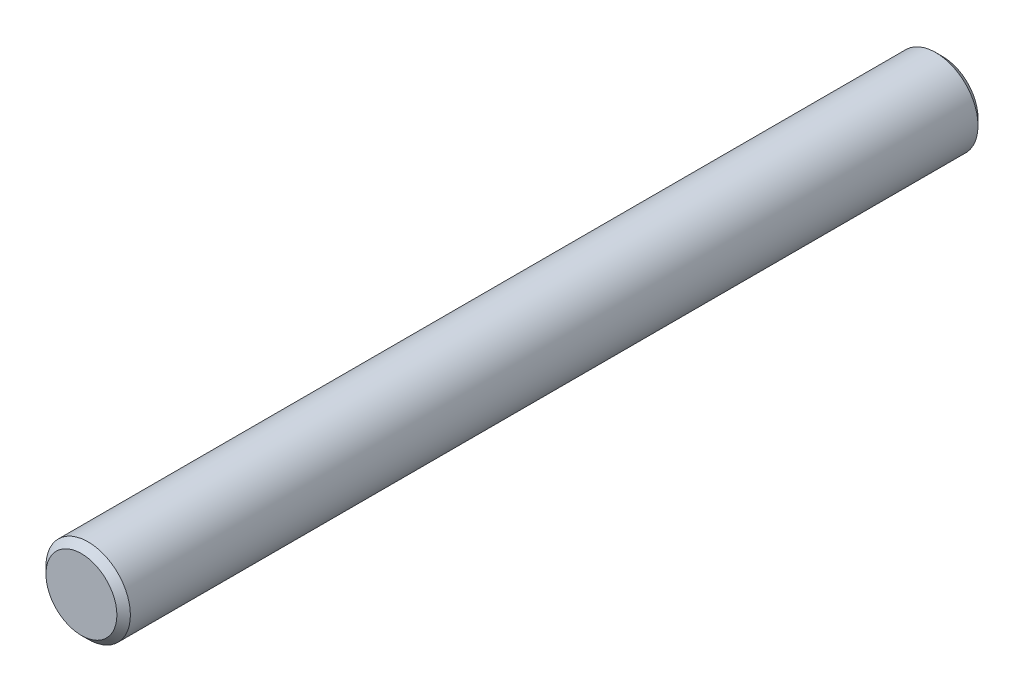
ISO-10303-21;
HEADER;
FILE_DESCRIPTION(('STEP AP214'),'2;1');
FILE_NAME('part.step','',(''),(''),'','','');
FILE_SCHEMA(('AUTOMOTIVE_DESIGN { 1 0 10303 214 1 1 1 1 }'));
ENDSEC;
DATA;
#1=APPLICATION_CONTEXT('core data for automotive mechanical design processes');
#2=APPLICATION_PROTOCOL_DEFINITION('international standard','automotive_design',2000,#1);
#3=PRODUCT_CONTEXT('',#1,'mechanical');
#4=PRODUCT('Part','Part','',(#3));
#5=PRODUCT_RELATED_PRODUCT_CATEGORY('part','',(#4));
#6=PRODUCT_DEFINITION_FORMATION('','',#4);
#7=PRODUCT_DEFINITION_CONTEXT('part definition',#1,'design');
#8=PRODUCT_DEFINITION('design','',#6,#7);
#9=PRODUCT_DEFINITION_SHAPE('','',#8);
#10=(LENGTH_UNIT() NAMED_UNIT(*) SI_UNIT(.MILLI.,.METRE.));
#11=(NAMED_UNIT(*) PLANE_ANGLE_UNIT() SI_UNIT($,.RADIAN.));
#12=(NAMED_UNIT(*) SI_UNIT($,.STERADIAN.) SOLID_ANGLE_UNIT());
#13=UNCERTAINTY_MEASURE_WITH_UNIT(LENGTH_MEASURE(1.E-05),#10,'distance_accuracy_value','');
#14=(GEOMETRIC_REPRESENTATION_CONTEXT(3) GLOBAL_UNCERTAINTY_ASSIGNED_CONTEXT((#13)) GLOBAL_UNIT_ASSIGNED_CONTEXT((#10,
#11,#12)) REPRESENTATION_CONTEXT('',''));
#15=CARTESIAN_POINT('',(0.,0.,0.));
#16=DIRECTION('',(0.,0.,1.));
#17=DIRECTION('',(1.,0.,0.));
#18=AXIS2_PLACEMENT_3D('',#15,#16,#17);
#19=CARTESIAN_POINT('',(0.,0.,48.560000034));
#20=DIRECTION('',(0.,0.,-1.));
#21=DIRECTION('',(-1.,0.,0.));
#22=AXIS2_PLACEMENT_3D('',#19,#20,#21);
#23=CYLINDRICAL_SURFACE('',#22,2.38125);
#24=CARTESIAN_POINT('',(0.,0.,0.380999999999986));
#25=DIRECTION('',(0.,0.,1.));
#26=DIRECTION('',(1.,0.,0.));
#27=AXIS2_PLACEMENT_3D('',#24,#25,#26);
#28=CIRCLE('',#27,2.38125);
#29=CARTESIAN_POINT('',(2.38125,0.,0.380999999999986));
#30=VERTEX_POINT('',#29);
#31=EDGE_CURVE('E42',#30,#30,#28,.T.);
#32=ORIENTED_EDGE('',*,*,#31,.T.);
#33=EDGE_LOOP('',(#32));
#34=FACE_BOUND('',#33,.T.);
#35=CARTESIAN_POINT('',(0.,0.,48.179000034));
#36=DIRECTION('',(0.,0.,1.));
#37=DIRECTION('',(1.,0.,0.));
#38=AXIS2_PLACEMENT_3D('',#35,#36,#37);
#39=CIRCLE('',#38,2.38125);
#40=CARTESIAN_POINT('',(2.38125,0.,48.179000034));
#41=VERTEX_POINT('',#40);
#42=EDGE_CURVE('E46',#41,#41,#39,.F.);
#43=ORIENTED_EDGE('',*,*,#42,.T.);
#44=EDGE_LOOP('',(#43));
#45=FACE_BOUND('',#44,.T.);
#46=ADVANCED_FACE('F31',(#34,#45),#23,.T.);
#47=CARTESIAN_POINT('',(0.,0.,48.560000034));
#48=DIRECTION('',(0.,0.,1.));
#49=DIRECTION('',(1.,0.,0.));
#50=AXIS2_PLACEMENT_3D('',#47,#48,#49);
#51=PLANE('',#50);
#52=CARTESIAN_POINT('',(0.,0.,48.560000034));
#53=DIRECTION('',(0.,0.,1.));
#54=DIRECTION('',(1.,0.,0.));
#55=AXIS2_PLACEMENT_3D('',#52,#53,#54);
#56=CIRCLE('',#55,2.00025);
#57=CARTESIAN_POINT('',(2.00025,0.,48.560000034));
#58=VERTEX_POINT('',#57);
#59=EDGE_CURVE('E10',#58,#58,#56,.T.);
#60=ORIENTED_EDGE('',*,*,#59,.T.);
#61=EDGE_LOOP('',(#60));
#62=FACE_BOUND('',#61,.T.);
#63=ADVANCED_FACE('F62',(#62),#51,.T.);
#64=CARTESIAN_POINT('',(0.,0.,0.));
#65=DIRECTION('',(0.,0.,1.));
#66=DIRECTION('',(1.,0.,0.));
#67=AXIS2_PLACEMENT_3D('',#64,#65,#66);
#68=PLANE('',#67);
#69=CARTESIAN_POINT('',(0.,0.,0.));
#70=DIRECTION('',(0.,0.,1.));
#71=DIRECTION('',(1.,0.,0.));
#72=AXIS2_PLACEMENT_3D('',#69,#70,#71);
#73=CIRCLE('',#72,2.00025000000002);
#74=CARTESIAN_POINT('',(2.00025000000002,0.,0.));
#75=VERTEX_POINT('',#74);
#76=EDGE_CURVE('E38',#75,#75,#73,.F.);
#77=ORIENTED_EDGE('',*,*,#76,.T.);
#78=EDGE_LOOP('',(#77));
#79=FACE_BOUND('',#78,.T.);
#80=ADVANCED_FACE('F59',(#79),#68,.F.);
#81=CARTESIAN_POINT('',(0.,0.,0.380999999999986));
#82=DIRECTION('',(0.,0.,1.));
#83=DIRECTION('',(1.,0.,0.));
#84=AXIS2_PLACEMENT_3D('',#81,#82,#83);
#85=CONICAL_SURFACE('',#84,2.38125,0.785398163397447);
#86=ORIENTED_EDGE('',*,*,#76,.F.);
#87=EDGE_LOOP('',(#86));
#88=FACE_BOUND('',#87,.T.);
#89=ORIENTED_EDGE('',*,*,#31,.F.);
#90=EDGE_LOOP('',(#89));
#91=FACE_BOUND('',#90,.T.);
#92=ADVANCED_FACE('F55',(#88,#91),#85,.T.);
#93=CARTESIAN_POINT('',(0.,0.,48.560000034));
#94=DIRECTION('',(0.,0.,-1.));
#95=DIRECTION('',(-1.,0.,0.));
#96=AXIS2_PLACEMENT_3D('',#93,#94,#95);
#97=CONICAL_SURFACE('',#96,2.00025,0.785398163397456);
#98=ORIENTED_EDGE('',*,*,#42,.F.);
#99=EDGE_LOOP('',(#98));
#100=FACE_BOUND('',#99,.T.);
#101=ORIENTED_EDGE('',*,*,#59,.F.);
#102=EDGE_LOOP('',(#101));
#103=FACE_BOUND('',#102,.T.);
#104=ADVANCED_FACE('F33',(#100,#103),#97,.T.);
#105=CLOSED_SHELL('',(#46,#63,#80,#92,#104));
#106=MANIFOLD_SOLID_BREP('B2',#105);
#107=ADVANCED_BREP_SHAPE_REPRESENTATION('',(#18,#106),#14);
#108=SHAPE_DEFINITION_REPRESENTATION(#9,#107);
ENDSEC;
END-ISO-10303-21;
